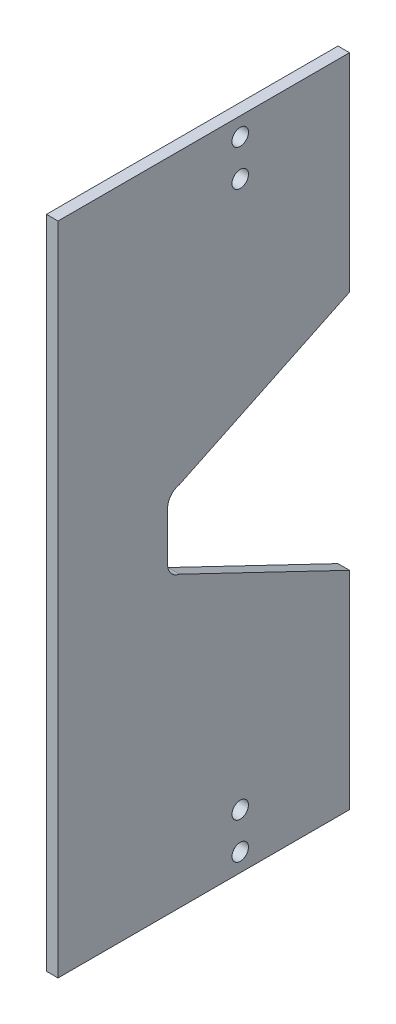
ISO-10303-21;
HEADER;
FILE_DESCRIPTION(('STEP AP214'),'2;1');
FILE_NAME('part.step','',(''),(''),'','','');
FILE_SCHEMA(('AUTOMOTIVE_DESIGN { 1 0 10303 214 1 1 1 1 }'));
ENDSEC;
DATA;
#1=APPLICATION_CONTEXT('core data for automotive mechanical design processes');
#2=APPLICATION_PROTOCOL_DEFINITION('international standard','automotive_design',2000,#1);
#3=PRODUCT_CONTEXT('',#1,'mechanical');
#4=PRODUCT('Part','Part','',(#3));
#5=PRODUCT_RELATED_PRODUCT_CATEGORY('part','',(#4));
#6=PRODUCT_DEFINITION_FORMATION('','',#4);
#7=PRODUCT_DEFINITION_CONTEXT('part definition',#1,'design');
#8=PRODUCT_DEFINITION('design','',#6,#7);
#9=PRODUCT_DEFINITION_SHAPE('','',#8);
#10=(LENGTH_UNIT() NAMED_UNIT(*) SI_UNIT(.MILLI.,.METRE.));
#11=(NAMED_UNIT(*) PLANE_ANGLE_UNIT() SI_UNIT($,.RADIAN.));
#12=(NAMED_UNIT(*) SI_UNIT($,.STERADIAN.) SOLID_ANGLE_UNIT());
#13=UNCERTAINTY_MEASURE_WITH_UNIT(LENGTH_MEASURE(1.E-05),#10,'distance_accuracy_value','');
#14=(GEOMETRIC_REPRESENTATION_CONTEXT(3) GLOBAL_UNCERTAINTY_ASSIGNED_CONTEXT((#13)) GLOBAL_UNIT_ASSIGNED_CONTEXT((#10,
#11,#12)) REPRESENTATION_CONTEXT('',''));
#15=CARTESIAN_POINT('',(0.,0.,0.));
#16=DIRECTION('',(0.,0.,1.));
#17=DIRECTION('',(1.,0.,0.));
#18=AXIS2_PLACEMENT_3D('',#15,#16,#17);
#19=CARTESIAN_POINT('',(0.794249999999998,-10.795,3.));
#20=DIRECTION('',(0.,1.,0.));
#21=DIRECTION('',(0.,0.,1.));
#22=AXIS2_PLACEMENT_3D('',#19,#20,#21);
#23=PLANE('',#22);
#24=DIRECTION('',(0.,0.,-1.));
#25=VECTOR('',#24,1.);
#26=CARTESIAN_POINT('',(-0.793750000000003,-10.795,3.));
#27=LINE('',#26,#25);
#28=CARTESIAN_POINT('',(-0.793750000000006,-10.795,15.));
#29=VERTEX_POINT('',#28);
#30=CARTESIAN_POINT('',(-0.793749999999994,-10.795,-25.));
#31=VERTEX_POINT('',#30);
#32=EDGE_CURVE('E190',#29,#31,#27,.T.);
#33=ORIENTED_EDGE('',*,*,#32,.F.);
#34=DIRECTION('',(1.,0.,0.));
#35=VECTOR('',#34,1.);
#36=CARTESIAN_POINT('',(-0.793750000000006,-10.795,15.));
#37=LINE('',#36,#35);
#38=CARTESIAN_POINT('',(0.794249999999994,-10.795,15.));
#39=VERTEX_POINT('',#38);
#40=EDGE_CURVE('E156',#29,#39,#37,.T.);
#41=ORIENTED_EDGE('',*,*,#40,.T.);
#42=DIRECTION('',(0.,0.,-1.));
#43=VECTOR('',#42,1.);
#44=CARTESIAN_POINT('',(0.794249999999998,-10.795,3.));
#45=LINE('',#44,#43);
#46=CARTESIAN_POINT('',(0.794250000000006,-10.795,-25.));
#47=VERTEX_POINT('',#46);
#48=EDGE_CURVE('E192',#39,#47,#45,.T.);
#49=ORIENTED_EDGE('',*,*,#48,.T.);
#50=DIRECTION('',(1.,0.,0.));
#51=VECTOR('',#50,1.);
#52=CARTESIAN_POINT('',(-0.793749999999994,-10.795,-25.));
#53=LINE('',#52,#51);
#54=EDGE_CURVE('E132',#31,#47,#53,.T.);
#55=ORIENTED_EDGE('',*,*,#54,.F.);
#56=EDGE_LOOP('',(#33,#41,#49,#55));
#57=FACE_BOUND('',#56,.T.);
#58=ADVANCED_FACE('F38',(#57),#23,.T.);
#59=CARTESIAN_POINT('',(0.794249999999998,-100.745,3.));
#60=DIRECTION('',(0.,-1.,0.));
#61=DIRECTION('',(0.,0.,-1.));
#62=AXIS2_PLACEMENT_3D('',#59,#60,#61);
#63=PLANE('',#62);
#64=DIRECTION('',(0.,0.,1.));
#65=VECTOR('',#64,1.);
#66=CARTESIAN_POINT('',(-0.793750000000003,-100.745,3.));
#67=LINE('',#66,#65);
#68=CARTESIAN_POINT('',(-0.793749999999994,-100.745,-25.));
#69=VERTEX_POINT('',#68);
#70=CARTESIAN_POINT('',(-0.793750000000006,-100.745,15.));
#71=VERTEX_POINT('',#70);
#72=EDGE_CURVE('E197',#69,#71,#67,.T.);
#73=ORIENTED_EDGE('',*,*,#72,.F.);
#74=DIRECTION('',(1.,0.,0.));
#75=VECTOR('',#74,1.);
#76=CARTESIAN_POINT('',(-0.793749999999994,-100.745,-25.));
#77=LINE('',#76,#75);
#78=CARTESIAN_POINT('',(0.794250000000006,-100.745,-25.));
#79=VERTEX_POINT('',#78);
#80=EDGE_CURVE('E144',#69,#79,#77,.T.);
#81=ORIENTED_EDGE('',*,*,#80,.T.);
#82=DIRECTION('',(0.,0.,1.));
#83=VECTOR('',#82,1.);
#84=CARTESIAN_POINT('',(0.794249999999998,-100.745,3.));
#85=LINE('',#84,#83);
#86=CARTESIAN_POINT('',(0.794249999999994,-100.745,15.));
#87=VERTEX_POINT('',#86);
#88=EDGE_CURVE('E189',#79,#87,#85,.T.);
#89=ORIENTED_EDGE('',*,*,#88,.T.);
#90=DIRECTION('',(1.,0.,0.));
#91=VECTOR('',#90,1.);
#92=CARTESIAN_POINT('',(-0.793750000000006,-100.745,15.));
#93=LINE('',#92,#91);
#94=EDGE_CURVE('E153',#71,#87,#93,.T.);
#95=ORIENTED_EDGE('',*,*,#94,.F.);
#96=EDGE_LOOP('',(#73,#81,#89,#95));
#97=FACE_BOUND('',#96,.T.);
#98=ADVANCED_FACE('F241',(#97),#63,.T.);
#99=CARTESIAN_POINT('',(0.794249999999999,-55.77,-0.0391447555514949));
#100=DIRECTION('',(0.,0.,-1.));
#101=DIRECTION('',(-1.,0.,0.));
#102=AXIS2_PLACEMENT_3D('',#99,#100,#101);
#103=PLANE('',#102);
#104=DIRECTION('',(0.,-1.,0.));
#105=VECTOR('',#104,1.);
#106=CARTESIAN_POINT('',(0.794249999999999,-55.77,-0.0391447555514949));
#107=LINE('',#106,#105);
#108=CARTESIAN_POINT('',(0.794249999999999,-52.4114543338415,-0.0391447555514951));
#109=VERTEX_POINT('',#108);
#110=CARTESIAN_POINT('',(0.794249999999999,-59.1285456661585,-0.0391447555514947));
#111=VERTEX_POINT('',#110);
#112=EDGE_CURVE('E186',#109,#111,#107,.T.);
#113=ORIENTED_EDGE('',*,*,#112,.T.);
#114=DIRECTION('',(-1.,0.,0.));
#115=VECTOR('',#114,1.);
#116=CARTESIAN_POINT('',(-0.793750000000001,-59.1285456661585,-0.0391447555514947));
#117=LINE('',#116,#115);
#118=CARTESIAN_POINT('',(-0.793750000000002,-59.1285456661585,-0.0391447555514946));
#119=VERTEX_POINT('',#118);
#120=EDGE_CURVE('E207',#111,#119,#117,.T.);
#121=ORIENTED_EDGE('',*,*,#120,.T.);
#122=DIRECTION('',(0.,-1.,0.));
#123=VECTOR('',#122,1.);
#124=CARTESIAN_POINT('',(-0.793750000000002,-55.77,-0.0391447555514954));
#125=LINE('',#124,#123);
#126=CARTESIAN_POINT('',(-0.793750000000002,-52.4114543338415,-0.0391447555514961));
#127=VERTEX_POINT('',#126);
#128=EDGE_CURVE('E183',#127,#119,#125,.T.);
#129=ORIENTED_EDGE('',*,*,#128,.F.);
#130=DIRECTION('',(-1.,0.,0.));
#131=VECTOR('',#130,1.);
#132=CARTESIAN_POINT('',(0.794249999999999,-52.4114543338415,-0.0391447555514956));
#133=LINE('',#132,#131);
#134=EDGE_CURVE('E202',#127,#109,#133,.F.);
#135=ORIENTED_EDGE('',*,*,#134,.T.);
#136=EDGE_LOOP('',(#113,#121,#129,#135));
#137=FACE_BOUND('',#136,.T.);
#138=ADVANCED_FACE('F220',(#137),#103,.T.);
#139=CARTESIAN_POINT('',(0.794250000000003,-12.795,-13.));
#140=DIRECTION('',(-1.,0.,0.));
#141=DIRECTION('',(0.,0.,1.));
#142=AXIS2_PLACEMENT_3D('',#139,#140,#141);
#143=PLANE('',#142);
#144=CARTESIAN_POINT('',(0.794249999999999,-52.4114543338415,-2.03914475555149));
#145=DIRECTION('',(-1.,0.,0.));
#146=DIRECTION('',(0.,0.,1.));
#147=AXIS2_PLACEMENT_3D('',#144,#145,#146);
#148=CIRCLE('',#147,2.);
#149=CARTESIAN_POINT('',(0.794249999999999,-50.4498612190227,-1.64907751532796));
#150=VERTEX_POINT('',#149);
#151=EDGE_CURVE('E126',#109,#150,#148,.T.);
#152=ORIENTED_EDGE('',*,*,#151,.T.);
#153=DIRECTION('',(0.,-0.432718299890711,0.901529185850182));
#154=VECTOR('',#153,1.);
#155=CARTESIAN_POINT('',(0.794249999999999,-50.4498612190227,-1.64907751532796));
#156=LINE('',#155,#154);
#157=CARTESIAN_POINT('',(0.794250000000006,-39.2418253206417,-25.));
#158=VERTEX_POINT('',#157);
#159=EDGE_CURVE('E113',#158,#150,#156,.T.);
#160=ORIENTED_EDGE('',*,*,#159,.F.);
#161=DIRECTION('',(0.,1.,0.));
#162=VECTOR('',#161,1.);
#163=CARTESIAN_POINT('',(0.794250000000006,-45.8064773177129,-25.));
#164=LINE('',#163,#162);
#165=EDGE_CURVE('E122',#158,#47,#164,.T.);
#166=ORIENTED_EDGE('',*,*,#165,.T.);
#167=ORIENTED_EDGE('',*,*,#48,.F.);
#168=DIRECTION('',(0.,-1.,0.));
#169=VECTOR('',#168,1.);
#170=CARTESIAN_POINT('',(0.794249999999994,-100.745,15.));
#171=LINE('',#170,#169);
#172=EDGE_CURVE('E149',#39,#87,#171,.T.);
#173=ORIENTED_EDGE('',*,*,#172,.T.);
#174=ORIENTED_EDGE('',*,*,#88,.F.);
#175=DIRECTION('',(0.,1.,0.));
#176=VECTOR('',#175,1.);
#177=CARTESIAN_POINT('',(0.794250000000006,-65.7335226822871,-25.));
#178=LINE('',#177,#176);
#179=CARTESIAN_POINT('',(0.794250000000006,-72.2981746793583,-25.));
#180=VERTEX_POINT('',#179);
#181=EDGE_CURVE('E140',#79,#180,#178,.T.);
#182=ORIENTED_EDGE('',*,*,#181,.T.);
#183=DIRECTION('',(0.,-0.432718299890711,-0.901529185850182));
#184=VECTOR('',#183,1.);
#185=CARTESIAN_POINT('',(0.794249999999999,-61.0901387809773,-1.64907751532796));
#186=LINE('',#185,#184);
#187=CARTESIAN_POINT('',(0.794249999999999,-61.0901387809773,-1.64907751532796));
#188=VERTEX_POINT('',#187);
#189=EDGE_CURVE('E52',#188,#180,#186,.T.);
#190=ORIENTED_EDGE('',*,*,#189,.F.);
#191=CARTESIAN_POINT('',(0.794249999999999,-59.1285456661585,-2.03914475555149));
#192=DIRECTION('',(-1.,0.,0.));
#193=DIRECTION('',(0.,0.,1.));
#194=AXIS2_PLACEMENT_3D('',#191,#192,#193);
#195=CIRCLE('',#194,2.);
#196=EDGE_CURVE('E118',#188,#111,#195,.T.);
#197=ORIENTED_EDGE('',*,*,#196,.T.);
#198=ORIENTED_EDGE('',*,*,#112,.F.);
#199=EDGE_LOOP('',(#152,#160,#166,#167,#173,#174,#182,#190,#197,#198));
#200=FACE_BOUND('',#199,.T.);
#201=CARTESIAN_POINT('',(0.794250000000002,-98.245,-10.));
#202=DIRECTION('',(-1.,0.,0.));
#203=DIRECTION('',(0.,0.,1.));
#204=AXIS2_PLACEMENT_3D('',#201,#202,#203);
#205=CIRCLE('',#204,1.1303);
#206=CARTESIAN_POINT('',(0.794250000000001,-98.245,-8.86969999999999));
#207=VERTEX_POINT('',#206);
#208=EDGE_CURVE('E162',#207,#207,#205,.T.);
#209=ORIENTED_EDGE('',*,*,#208,.T.);
#210=EDGE_LOOP('',(#209));
#211=FACE_BOUND('',#210,.T.);
#212=CARTESIAN_POINT('',(0.794250000000002,-93.245,-10.));
#213=DIRECTION('',(-1.,0.,0.));
#214=DIRECTION('',(0.,0.,1.));
#215=AXIS2_PLACEMENT_3D('',#212,#213,#214);
#216=CIRCLE('',#215,1.1303);
#217=CARTESIAN_POINT('',(0.794250000000001,-93.245,-8.8697));
#218=VERTEX_POINT('',#217);
#219=EDGE_CURVE('E168',#218,#218,#216,.T.);
#220=ORIENTED_EDGE('',*,*,#219,.T.);
#221=EDGE_LOOP('',(#220));
#222=FACE_BOUND('',#221,.T.);
#223=CARTESIAN_POINT('',(0.794250000000002,-18.295,-10.));
#224=DIRECTION('',(-1.,0.,0.));
#225=DIRECTION('',(0.,0.,1.));
#226=AXIS2_PLACEMENT_3D('',#223,#224,#225);
#227=CIRCLE('',#226,1.1303);
#228=CARTESIAN_POINT('',(0.794250000000001,-18.295,-8.8697));
#229=VERTEX_POINT('',#228);
#230=EDGE_CURVE('E174',#229,#229,#227,.T.);
#231=ORIENTED_EDGE('',*,*,#230,.T.);
#232=EDGE_LOOP('',(#231));
#233=FACE_BOUND('',#232,.T.);
#234=CARTESIAN_POINT('',(0.794250000000002,-13.295,-10.));
#235=DIRECTION('',(-1.,0.,0.));
#236=DIRECTION('',(0.,0.,1.));
#237=AXIS2_PLACEMENT_3D('',#234,#235,#236);
#238=CIRCLE('',#237,1.1303);
#239=CARTESIAN_POINT('',(0.794250000000001,-13.295,-8.8697));
#240=VERTEX_POINT('',#239);
#241=EDGE_CURVE('E180',#240,#240,#238,.T.);
#242=ORIENTED_EDGE('',*,*,#241,.T.);
#243=EDGE_LOOP('',(#242));
#244=FACE_BOUND('',#243,.T.);
#245=ADVANCED_FACE('F120',(#200,#211,#222,#233,#244),#143,.F.);
#246=CARTESIAN_POINT('',(-0.793749999999998,-12.795,-13.));
#247=DIRECTION('',(-1.,0.,0.));
#248=DIRECTION('',(0.,0.,1.));
#249=AXIS2_PLACEMENT_3D('',#246,#247,#248);
#250=PLANE('',#249);
#251=DIRECTION('',(0.,0.432718299890711,-0.901529185850183));
#252=VECTOR('',#251,1.);
#253=CARTESIAN_POINT('',(-0.793749999999994,-38.9710842723718,-25.5640643274959));
#254=LINE('',#253,#252);
#255=CARTESIAN_POINT('',(-0.793750000000001,-50.4498612190227,-1.64907751532796));
#256=VERTEX_POINT('',#255);
#257=CARTESIAN_POINT('',(-0.793749999999994,-39.2418253206417,-25.));
#258=VERTEX_POINT('',#257);
#259=EDGE_CURVE('E60',#256,#258,#254,.T.);
#260=ORIENTED_EDGE('',*,*,#259,.F.);
#261=CARTESIAN_POINT('',(-0.793750000000001,-52.4114543338415,-2.0391447555515));
#262=DIRECTION('',(-1.,0.,0.));
#263=DIRECTION('',(0.,0.,1.));
#264=AXIS2_PLACEMENT_3D('',#261,#262,#263);
#265=CIRCLE('',#264,2.);
#266=EDGE_CURVE('E204',#256,#127,#265,.F.);
#267=ORIENTED_EDGE('',*,*,#266,.T.);
#268=ORIENTED_EDGE('',*,*,#128,.T.);
#269=CARTESIAN_POINT('',(-0.793750000000001,-59.1285456661585,-2.03914475555149));
#270=DIRECTION('',(-1.,0.,0.));
#271=DIRECTION('',(0.,0.,1.));
#272=AXIS2_PLACEMENT_3D('',#269,#270,#271);
#273=CIRCLE('',#272,2.);
#274=CARTESIAN_POINT('',(-0.793750000000001,-61.0901387809773,-1.64907751532796));
#275=VERTEX_POINT('',#274);
#276=EDGE_CURVE('E212',#119,#275,#273,.F.);
#277=ORIENTED_EDGE('',*,*,#276,.T.);
#278=DIRECTION('',(0.,0.432718299890711,0.901529185850183));
#279=VECTOR('',#278,1.);
#280=CARTESIAN_POINT('',(-0.793750000000004,-56.4751970567948,7.96573345152744));
#281=LINE('',#280,#279);
#282=CARTESIAN_POINT('',(-0.793749999999994,-72.2981746793583,-25.));
#283=VERTEX_POINT('',#282);
#284=EDGE_CURVE('E134',#283,#275,#281,.T.);
#285=ORIENTED_EDGE('',*,*,#284,.F.);
#286=DIRECTION('',(0.,1.,0.));
#287=VECTOR('',#286,1.);
#288=CARTESIAN_POINT('',(-0.793749999999994,-65.7335226822871,-25.));
#289=LINE('',#288,#287);
#290=EDGE_CURVE('E141',#69,#283,#289,.T.);
#291=ORIENTED_EDGE('',*,*,#290,.F.);
#292=ORIENTED_EDGE('',*,*,#72,.T.);
#293=DIRECTION('',(0.,-1.,0.));
#294=VECTOR('',#293,1.);
#295=CARTESIAN_POINT('',(-0.793750000000006,-100.745,15.));
#296=LINE('',#295,#294);
#297=EDGE_CURVE('E150',#29,#71,#296,.T.);
#298=ORIENTED_EDGE('',*,*,#297,.F.);
#299=ORIENTED_EDGE('',*,*,#32,.T.);
#300=DIRECTION('',(0.,1.,0.));
#301=VECTOR('',#300,1.);
#302=CARTESIAN_POINT('',(-0.793749999999994,-45.8064773177129,-25.));
#303=LINE('',#302,#301);
#304=EDGE_CURVE('E133',#258,#31,#303,.T.);
#305=ORIENTED_EDGE('',*,*,#304,.F.);
#306=EDGE_LOOP('',(#260,#267,#268,#277,#285,#291,#292,#298,#299,#305));
#307=FACE_BOUND('',#306,.T.);
#308=CARTESIAN_POINT('',(-0.793749999999998,-98.245,-10.));
#309=DIRECTION('',(-1.,0.,0.));
#310=DIRECTION('',(0.,0.,1.));
#311=AXIS2_PLACEMENT_3D('',#308,#309,#310);
#312=CIRCLE('',#311,1.1303);
#313=CARTESIAN_POINT('',(-0.793749999999999,-98.245,-8.86969999999999));
#314=VERTEX_POINT('',#313);
#315=EDGE_CURVE('E159',#314,#314,#312,.T.);
#316=ORIENTED_EDGE('',*,*,#315,.F.);
#317=EDGE_LOOP('',(#316));
#318=FACE_BOUND('',#317,.T.);
#319=CARTESIAN_POINT('',(-0.793749999999998,-93.245,-10.));
#320=DIRECTION('',(-1.,0.,0.));
#321=DIRECTION('',(0.,0.,1.));
#322=AXIS2_PLACEMENT_3D('',#319,#320,#321);
#323=CIRCLE('',#322,1.1303);
#324=CARTESIAN_POINT('',(-0.793749999999999,-93.245,-8.8697));
#325=VERTEX_POINT('',#324);
#326=EDGE_CURVE('E165',#325,#325,#323,.T.);
#327=ORIENTED_EDGE('',*,*,#326,.F.);
#328=EDGE_LOOP('',(#327));
#329=FACE_BOUND('',#328,.T.);
#330=CARTESIAN_POINT('',(-0.793749999999998,-18.295,-10.));
#331=DIRECTION('',(-1.,0.,0.));
#332=DIRECTION('',(0.,0.,1.));
#333=AXIS2_PLACEMENT_3D('',#330,#331,#332);
#334=CIRCLE('',#333,1.1303);
#335=CARTESIAN_POINT('',(-0.793749999999999,-18.295,-8.8697));
#336=VERTEX_POINT('',#335);
#337=EDGE_CURVE('E171',#336,#336,#334,.T.);
#338=ORIENTED_EDGE('',*,*,#337,.F.);
#339=EDGE_LOOP('',(#338));
#340=FACE_BOUND('',#339,.T.);
#341=CARTESIAN_POINT('',(-0.793749999999998,-13.295,-10.));
#342=DIRECTION('',(-1.,0.,0.));
#343=DIRECTION('',(0.,0.,1.));
#344=AXIS2_PLACEMENT_3D('',#341,#342,#343);
#345=CIRCLE('',#344,1.1303);
#346=CARTESIAN_POINT('',(-0.793749999999999,-13.295,-8.8697));
#347=VERTEX_POINT('',#346);
#348=EDGE_CURVE('E177',#347,#347,#345,.T.);
#349=ORIENTED_EDGE('',*,*,#348,.F.);
#350=EDGE_LOOP('',(#349));
#351=FACE_BOUND('',#350,.T.);
#352=ADVANCED_FACE('F225',(#307,#318,#329,#340,#351),#250,.T.);
#353=CARTESIAN_POINT('',(0.794250000000002,-13.295,-10.));
#354=DIRECTION('',(-1.,0.,0.));
#355=DIRECTION('',(0.,0.,1.));
#356=AXIS2_PLACEMENT_3D('',#353,#354,#355);
#357=CYLINDRICAL_SURFACE('',#356,1.1303);
#358=ORIENTED_EDGE('',*,*,#241,.F.);
#359=EDGE_LOOP('',(#358));
#360=FACE_BOUND('',#359,.T.);
#361=ORIENTED_EDGE('',*,*,#348,.T.);
#362=EDGE_LOOP('',(#361));
#363=FACE_BOUND('',#362,.T.);
#364=ADVANCED_FACE('F286',(#360,#363),#357,.F.);
#365=CARTESIAN_POINT('',(0.794250000000002,-18.295,-10.));
#366=DIRECTION('',(-1.,0.,0.));
#367=DIRECTION('',(0.,0.,1.));
#368=AXIS2_PLACEMENT_3D('',#365,#366,#367);
#369=CYLINDRICAL_SURFACE('',#368,1.1303);
#370=ORIENTED_EDGE('',*,*,#230,.F.);
#371=EDGE_LOOP('',(#370));
#372=FACE_BOUND('',#371,.T.);
#373=ORIENTED_EDGE('',*,*,#337,.T.);
#374=EDGE_LOOP('',(#373));
#375=FACE_BOUND('',#374,.T.);
#376=ADVANCED_FACE('F276',(#372,#375),#369,.F.);
#377=CARTESIAN_POINT('',(0.794250000000002,-93.245,-10.));
#378=DIRECTION('',(-1.,0.,0.));
#379=DIRECTION('',(0.,0.,1.));
#380=AXIS2_PLACEMENT_3D('',#377,#378,#379);
#381=CYLINDRICAL_SURFACE('',#380,1.1303);
#382=ORIENTED_EDGE('',*,*,#219,.F.);
#383=EDGE_LOOP('',(#382));
#384=FACE_BOUND('',#383,.T.);
#385=ORIENTED_EDGE('',*,*,#326,.T.);
#386=EDGE_LOOP('',(#385));
#387=FACE_BOUND('',#386,.T.);
#388=ADVANCED_FACE('F270',(#384,#387),#381,.F.);
#389=CARTESIAN_POINT('',(0.794250000000002,-98.245,-10.));
#390=DIRECTION('',(-1.,0.,0.));
#391=DIRECTION('',(0.,0.,1.));
#392=AXIS2_PLACEMENT_3D('',#389,#390,#391);
#393=CYLINDRICAL_SURFACE('',#392,1.1303);
#394=ORIENTED_EDGE('',*,*,#208,.F.);
#395=EDGE_LOOP('',(#394));
#396=FACE_BOUND('',#395,.T.);
#397=ORIENTED_EDGE('',*,*,#315,.T.);
#398=EDGE_LOOP('',(#397));
#399=FACE_BOUND('',#398,.T.);
#400=ADVANCED_FACE('F265',(#396,#399),#393,.F.);
#401=CARTESIAN_POINT('',(0.794249999999999,-52.4114543338415,-2.03914475555149));
#402=DIRECTION('',(1.,0.,0.));
#403=DIRECTION('',(0.,0.,-1.));
#404=AXIS2_PLACEMENT_3D('',#401,#402,#403);
#405=CYLINDRICAL_SURFACE('',#404,2.);
#406=ORIENTED_EDGE('',*,*,#151,.F.);
#407=ORIENTED_EDGE('',*,*,#134,.F.);
#408=ORIENTED_EDGE('',*,*,#266,.F.);
#409=DIRECTION('',(-1.,0.,0.));
#410=VECTOR('',#409,1.);
#411=CARTESIAN_POINT('',(-0.793750000000001,-50.4498612190227,-1.64907751532796));
#412=LINE('',#411,#410);
#413=EDGE_CURVE('E194',#150,#256,#412,.T.);
#414=ORIENTED_EDGE('',*,*,#413,.F.);
#415=EDGE_LOOP('',(#406,#407,#408,#414));
#416=FACE_BOUND('',#415,.T.);
#417=ADVANCED_FACE('F230',(#416),#405,.F.);
#418=CARTESIAN_POINT('',(0.794249999999999,-59.1285456661585,-2.03914475555149));
#419=DIRECTION('',(1.,0.,0.));
#420=DIRECTION('',(0.,0.,-1.));
#421=AXIS2_PLACEMENT_3D('',#418,#419,#420);
#422=CYLINDRICAL_SURFACE('',#421,2.);
#423=ORIENTED_EDGE('',*,*,#196,.F.);
#424=DIRECTION('',(-1.,0.,0.));
#425=VECTOR('',#424,1.);
#426=CARTESIAN_POINT('',(0.794249999999999,-61.0901387809773,-1.64907751532796));
#427=LINE('',#426,#425);
#428=EDGE_CURVE('E210',#275,#188,#427,.F.);
#429=ORIENTED_EDGE('',*,*,#428,.F.);
#430=ORIENTED_EDGE('',*,*,#276,.F.);
#431=ORIENTED_EDGE('',*,*,#120,.F.);
#432=EDGE_LOOP('',(#423,#429,#430,#431));
#433=FACE_BOUND('',#432,.T.);
#434=ADVANCED_FACE('F40',(#433),#422,.F.);
#435=CARTESIAN_POINT('',(-0.793750000000006,-100.745,15.));
#436=DIRECTION('',(0.,0.,1.));
#437=DIRECTION('',(1.,0.,0.));
#438=AXIS2_PLACEMENT_3D('',#435,#436,#437);
#439=PLANE('',#438);
#440=ORIENTED_EDGE('',*,*,#172,.F.);
#441=ORIENTED_EDGE('',*,*,#40,.F.);
#442=ORIENTED_EDGE('',*,*,#297,.T.);
#443=ORIENTED_EDGE('',*,*,#94,.T.);
#444=EDGE_LOOP('',(#440,#441,#442,#443));
#445=FACE_BOUND('',#444,.T.);
#446=ADVANCED_FACE('F238',(#445),#439,.T.);
#447=CARTESIAN_POINT('',(-0.793749999999994,-65.7335226822871,-25.));
#448=DIRECTION('',(0.,0.,-1.));
#449=DIRECTION('',(-1.,0.,0.));
#450=AXIS2_PLACEMENT_3D('',#447,#448,#449);
#451=PLANE('',#450);
#452=DIRECTION('',(-1.,0.,0.));
#453=VECTOR('',#452,1.);
#454=CARTESIAN_POINT('',(-0.793749999999994,-72.2981746793583,-25.));
#455=LINE('',#454,#453);
#456=EDGE_CURVE('E11',#180,#283,#455,.T.);
#457=ORIENTED_EDGE('',*,*,#456,.F.);
#458=ORIENTED_EDGE('',*,*,#181,.F.);
#459=ORIENTED_EDGE('',*,*,#80,.F.);
#460=ORIENTED_EDGE('',*,*,#290,.T.);
#461=EDGE_LOOP('',(#457,#458,#459,#460));
#462=FACE_BOUND('',#461,.T.);
#463=ADVANCED_FACE('F245',(#462),#451,.T.);
#464=CARTESIAN_POINT('',(-0.793749999999994,-45.8064773177129,-25.));
#465=DIRECTION('',(0.,0.,-1.));
#466=DIRECTION('',(-1.,0.,0.));
#467=AXIS2_PLACEMENT_3D('',#464,#465,#466);
#468=PLANE('',#467);
#469=DIRECTION('',(1.,0.,0.));
#470=VECTOR('',#469,1.);
#471=CARTESIAN_POINT('',(-0.793749999999994,-39.2418253206417,-25.));
#472=LINE('',#471,#470);
#473=EDGE_CURVE('E46',#258,#158,#472,.T.);
#474=ORIENTED_EDGE('',*,*,#473,.F.);
#475=ORIENTED_EDGE('',*,*,#304,.T.);
#476=ORIENTED_EDGE('',*,*,#54,.T.);
#477=ORIENTED_EDGE('',*,*,#165,.F.);
#478=EDGE_LOOP('',(#474,#475,#476,#477));
#479=FACE_BOUND('',#478,.T.);
#480=ADVANCED_FACE('F130',(#479),#468,.T.);
#481=CARTESIAN_POINT('',(-9.20575,-50.4498612190227,-1.64907751532796));
#482=DIRECTION('',(0.,0.901529185850182,0.432718299890711));
#483=DIRECTION('',(0.,-0.432718299890711,0.901529185850183));
#484=AXIS2_PLACEMENT_3D('',#481,#482,#483);
#485=PLANE('',#484);
#486=ORIENTED_EDGE('',*,*,#259,.T.);
#487=ORIENTED_EDGE('',*,*,#473,.T.);
#488=ORIENTED_EDGE('',*,*,#159,.T.);
#489=ORIENTED_EDGE('',*,*,#413,.T.);
#490=EDGE_LOOP('',(#486,#487,#488,#489));
#491=FACE_BOUND('',#490,.T.);
#492=ADVANCED_FACE('F112',(#491),#485,.F.);
#493=CARTESIAN_POINT('',(-9.20575,-61.0901387809773,-1.64907751532796));
#494=DIRECTION('',(0.,-0.901529185850182,0.432718299890711));
#495=DIRECTION('',(0.,-0.432718299890711,-0.901529185850183));
#496=AXIS2_PLACEMENT_3D('',#493,#494,#495);
#497=PLANE('',#496);
#498=ORIENTED_EDGE('',*,*,#284,.T.);
#499=ORIENTED_EDGE('',*,*,#428,.T.);
#500=ORIENTED_EDGE('',*,*,#189,.T.);
#501=ORIENTED_EDGE('',*,*,#456,.T.);
#502=EDGE_LOOP('',(#498,#499,#500,#501));
#503=FACE_BOUND('',#502,.T.);
#504=ADVANCED_FACE('F246',(#503),#497,.F.);
#505=CLOSED_SHELL('',(#58,#98,#138,#245,#352,#364,#376,#388,#400,#417,#434,#446,#463,#480,#492,#504));
#506=MANIFOLD_SOLID_BREP('B2',#505);
#507=ADVANCED_BREP_SHAPE_REPRESENTATION('',(#18,#506),#14);
#508=SHAPE_DEFINITION_REPRESENTATION(#9,#507);
ENDSEC;
END-ISO-10303-21;
